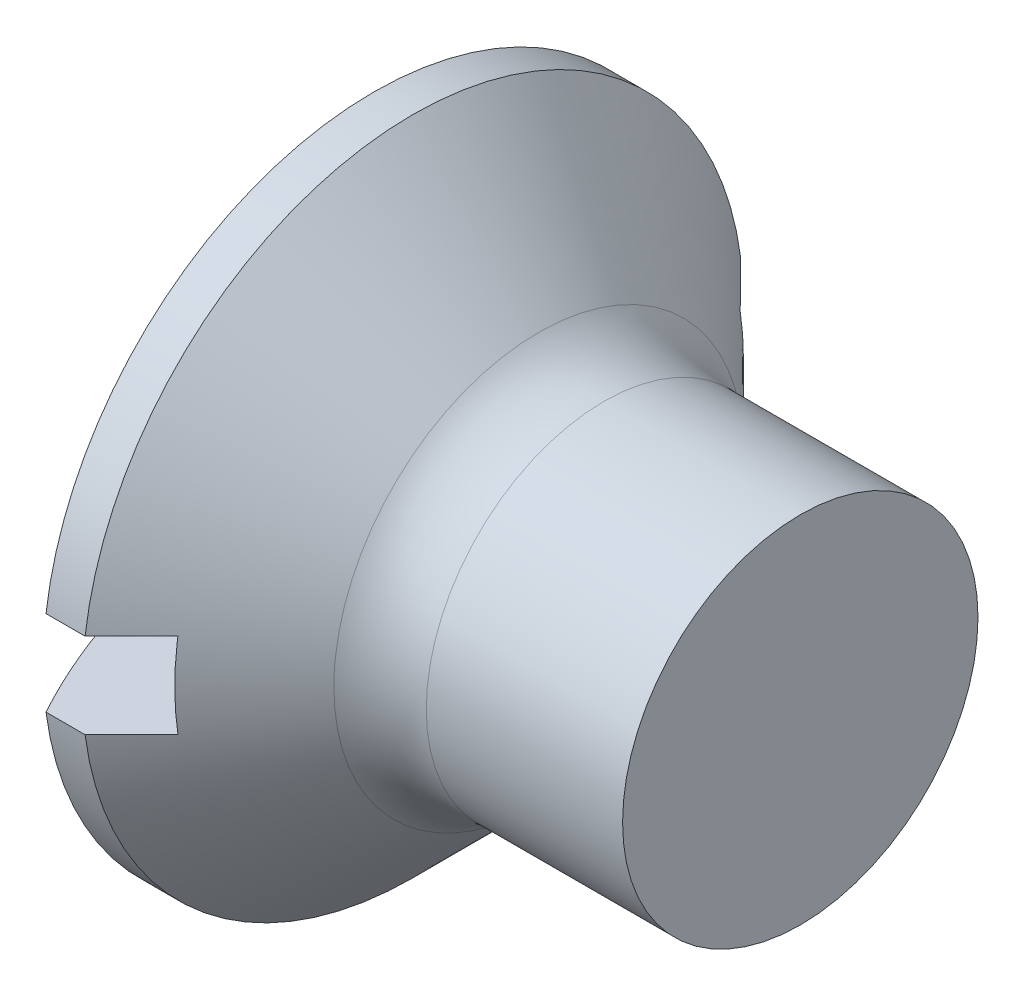
ISO-10303-21;
HEADER;
FILE_DESCRIPTION(('STEP AP214'),'2;1');
FILE_NAME('part.step','',(''),(''),'','','');
FILE_SCHEMA(('AUTOMOTIVE_DESIGN { 1 0 10303 214 1 1 1 1 }'));
ENDSEC;
DATA;
#1=APPLICATION_CONTEXT('core data for automotive mechanical design processes');
#2=APPLICATION_PROTOCOL_DEFINITION('international standard','automotive_design',2000,#1);
#3=PRODUCT_CONTEXT('',#1,'mechanical');
#4=PRODUCT('Part','Part','',(#3));
#5=PRODUCT_RELATED_PRODUCT_CATEGORY('part','',(#4));
#6=PRODUCT_DEFINITION_FORMATION('','',#4);
#7=PRODUCT_DEFINITION_CONTEXT('part definition',#1,'design');
#8=PRODUCT_DEFINITION('design','',#6,#7);
#9=PRODUCT_DEFINITION_SHAPE('','',#8);
#10=(LENGTH_UNIT() NAMED_UNIT(*) SI_UNIT(.MILLI.,.METRE.));
#11=(NAMED_UNIT(*) PLANE_ANGLE_UNIT() SI_UNIT($,.RADIAN.));
#12=(NAMED_UNIT(*) SI_UNIT($,.STERADIAN.) SOLID_ANGLE_UNIT());
#13=UNCERTAINTY_MEASURE_WITH_UNIT(LENGTH_MEASURE(1.E-05),#10,'distance_accuracy_value','');
#14=(GEOMETRIC_REPRESENTATION_CONTEXT(3) GLOBAL_UNCERTAINTY_ASSIGNED_CONTEXT((#13)) GLOBAL_UNIT_ASSIGNED_CONTEXT((#10,
#11,#12)) REPRESENTATION_CONTEXT('',''));
#15=CARTESIAN_POINT('',(0.,0.,0.));
#16=DIRECTION('',(0.,0.,1.));
#17=DIRECTION('',(1.,0.,0.));
#18=AXIS2_PLACEMENT_3D('',#15,#16,#17);
#19=CARTESIAN_POINT('',(9.60937500000001,0.,0.));
#20=DIRECTION('',(-1.,0.,0.));
#21=DIRECTION('',(0.,-1.,0.));
#22=AXIS2_PLACEMENT_3D('',#19,#20,#21);
#23=SPHERICAL_SURFACE('',#22,9.60937500000001);
#24=CARTESIAN_POINT('',(9.60937500000001,0.6,0.));
#25=DIRECTION('',(0.,1.,0.));
#26=DIRECTION('',(0.,0.,1.));
#27=AXIS2_PLACEMENT_3D('',#24,#25,#26);
#28=CIRCLE('',#27,9.59062500000001);
#29=CARTESIAN_POINT('',(1.2,0.6,4.61112784468182));
#30=VERTEX_POINT('',#29);
#31=CARTESIAN_POINT('',(1.2,0.6,-4.61112784468182));
#32=VERTEX_POINT('',#31);
#33=EDGE_CURVE('E182',#30,#32,#28,.F.);
#34=ORIENTED_EDGE('',*,*,#33,.F.);
#35=CARTESIAN_POINT('',(1.2,0.,0.));
#36=DIRECTION('',(-1.,0.,0.));
#37=DIRECTION('',(0.,0.,1.));
#38=AXIS2_PLACEMENT_3D('',#35,#36,#37);
#39=CIRCLE('',#38,4.65);
#40=EDGE_CURVE('E137',#30,#32,#39,.T.);
#41=ORIENTED_EDGE('',*,*,#40,.T.);
#42=EDGE_LOOP('',(#34,#41));
#43=FACE_BOUND('',#42,.T.);
#44=ADVANCED_FACE('F32',(#43),#23,.T.);
#45=CARTESIAN_POINT('',(-15.875,0.,0.));
#46=DIRECTION('',(-1.,0.,0.));
#47=DIRECTION('',(0.,0.,1.));
#48=AXIS2_PLACEMENT_3D('',#45,#46,#47);
#49=CYLINDRICAL_SURFACE('',#48,4.65);
#50=CARTESIAN_POINT('',(1.75000000000001,0.,0.));
#51=DIRECTION('',(-1.,0.,0.));
#52=DIRECTION('',(0.,0.,1.));
#53=AXIS2_PLACEMENT_3D('',#50,#51,#52);
#54=CIRCLE('',#53,4.65);
#55=CARTESIAN_POINT('',(1.75000000000001,0.6,4.61112784468182));
#56=VERTEX_POINT('',#55);
#57=CARTESIAN_POINT('',(1.75,0.6,-4.61112784468182));
#58=VERTEX_POINT('',#57);
#59=EDGE_CURVE('E108',#56,#58,#54,.T.);
#60=ORIENTED_EDGE('',*,*,#59,.T.);
#61=DIRECTION('',(-1.,0.,0.));
#62=VECTOR('',#61,1.);
#63=CARTESIAN_POINT('',(-15.875,0.6,-4.61112784468182));
#64=LINE('',#63,#62);
#65=EDGE_CURVE('E60',#58,#32,#64,.T.);
#66=ORIENTED_EDGE('',*,*,#65,.T.);
#67=ORIENTED_EDGE('',*,*,#40,.F.);
#68=DIRECTION('',(-1.,0.,0.));
#69=VECTOR('',#68,1.);
#70=CARTESIAN_POINT('',(-15.875,0.6,4.61112784468182));
#71=LINE('',#70,#69);
#72=EDGE_CURVE('E177',#30,#56,#71,.F.);
#73=ORIENTED_EDGE('',*,*,#72,.T.);
#74=EDGE_LOOP('',(#60,#66,#67,#73));
#75=FACE_BOUND('',#74,.T.);
#76=ADVANCED_FACE('F158',(#75),#49,.T.);
#77=CARTESIAN_POINT('',(7.2,0.,0.));
#78=DIRECTION('',(-1.,0.,0.));
#79=DIRECTION('',(0.,0.,1.));
#80=AXIS2_PLACEMENT_3D('',#77,#78,#79);
#81=PLANE('',#80);
#82=CARTESIAN_POINT('',(7.2,0.,0.));
#83=DIRECTION('',(-1.,0.,0.));
#84=DIRECTION('',(0.,0.,1.));
#85=AXIS2_PLACEMENT_3D('',#82,#83,#84);
#86=CIRCLE('',#85,2.5);
#87=CARTESIAN_POINT('',(7.2,0.,2.5));
#88=VERTEX_POINT('',#87);
#89=EDGE_CURVE('E130',#88,#88,#86,.T.);
#90=ORIENTED_EDGE('',*,*,#89,.F.);
#91=EDGE_LOOP('',(#90));
#92=FACE_BOUND('',#91,.T.);
#93=ADVANCED_FACE('F166',(#92),#81,.F.);
#94=CARTESIAN_POINT('',(9.60937500000001,-0.599999999999999,0.));
#95=DIRECTION('',(0.,-1.,0.));
#96=DIRECTION('',(0.,0.,-1.));
#97=AXIS2_PLACEMENT_3D('',#94,#95,#96);
#98=CIRCLE('',#97,9.59062500000001);
#99=CARTESIAN_POINT('',(1.2,-0.599999999999999,-4.61112784468182));
#100=VERTEX_POINT('',#99);
#101=CARTESIAN_POINT('',(1.2,-0.6,4.61112784468182));
#102=VERTEX_POINT('',#101);
#103=EDGE_CURVE('E128',#100,#102,#98,.F.);
#104=ORIENTED_EDGE('',*,*,#103,.F.);
#105=EDGE_CURVE('E127',#100,#102,#39,.T.);
#106=ORIENTED_EDGE('',*,*,#105,.T.);
#107=EDGE_LOOP('',(#104,#106));
#108=FACE_BOUND('',#107,.T.);
#109=ADVANCED_FACE('F156',(#108),#23,.T.);
#110=CARTESIAN_POINT('',(1.75000000000001,-0.599999999999999,-4.61112784468182));
#111=VERTEX_POINT('',#110);
#112=CARTESIAN_POINT('',(1.75,-0.6,4.61112784468182));
#113=VERTEX_POINT('',#112);
#114=EDGE_CURVE('E125',#111,#113,#54,.T.);
#115=ORIENTED_EDGE('',*,*,#114,.T.);
#116=DIRECTION('',(-1.,0.,0.));
#117=VECTOR('',#116,1.);
#118=CARTESIAN_POINT('',(-15.875,-0.6,4.61112784468182));
#119=LINE('',#118,#117);
#120=EDGE_CURVE('E175',#113,#102,#119,.T.);
#121=ORIENTED_EDGE('',*,*,#120,.T.);
#122=ORIENTED_EDGE('',*,*,#105,.F.);
#123=DIRECTION('',(-1.,0.,0.));
#124=VECTOR('',#123,1.);
#125=CARTESIAN_POINT('',(-15.875,-0.599999999999999,-4.61112784468182));
#126=LINE('',#125,#124);
#127=EDGE_CURVE('E117',#100,#111,#126,.F.);
#128=ORIENTED_EDGE('',*,*,#127,.T.);
#129=EDGE_LOOP('',(#115,#121,#122,#128));
#130=FACE_BOUND('',#129,.T.);
#131=ADVANCED_FACE('F123',(#130),#49,.T.);
#132=CARTESIAN_POINT('',(1.75000000000001,0.,0.));
#133=DIRECTION('',(-1.,0.,0.));
#134=DIRECTION('',(0.,0.,1.));
#135=AXIS2_PLACEMENT_3D('',#132,#133,#134);
#136=CONICAL_SURFACE('',#135,4.65,0.78539816339745);
#137=CARTESIAN_POINT('',(-3.84381242847589,0.6,-10.226225749014));
#138=CARTESIAN_POINT('',(-3.49703191125939,0.6,-9.87884438655969));
#139=CARTESIAN_POINT('',(-3.15027752264428,0.6,-9.53143692773832));
#140=CARTESIAN_POINT('',(-2.45684919071532,0.6,-8.83653285236268));
#141=CARTESIAN_POINT('',(-2.11017524848928,0.6,-8.48903623472294));
#142=CARTESIAN_POINT('',(-1.41684582915169,0.6,-7.79382645183445));
#143=CARTESIAN_POINT('',(-1.07019038563125,0.6,-7.44611325308074));
#144=CARTESIAN_POINT('',(-0.377062268390139,0.6,-6.75051339510871));
#145=CARTESIAN_POINT('',(-0.0305895924385831,0.6,-6.40262673811342));
#146=CARTESIAN_POINT('',(0.674964546705151,0.6,-5.6936216093589));
#147=CARTESIAN_POINT('',(1.03403537239449,0.6,-5.332492546491));
#148=CARTESIAN_POINT('',(1.57223610307804,0.6,-4.79038223073772));
#149=CARTESIAN_POINT('',(1.75157227236415,0.6,-4.60960579193032));
#150=CARTESIAN_POINT('',(2.11004634429561,0.6,-4.24785782662492));
#151=CARTESIAN_POINT('',(2.28918424772029,0.6,-4.06688630089932));
#152=CARTESIAN_POINT('',(2.64713893894737,0.6,-3.70469095359228));
#153=CARTESIAN_POINT('',(2.82595577933443,0.6,-3.52346718401695));
#154=CARTESIAN_POINT('',(3.18314009775668,0.6,-3.16057192469126));
#155=CARTESIAN_POINT('',(3.36150756896795,0.6,-2.97890042822381));
#156=CARTESIAN_POINT('',(3.71748512153374,0.6,-2.61483934310065));
#157=CARTESIAN_POINT('',(3.89509525439646,0.6,-2.43244980495716));
#158=CARTESIAN_POINT('',(4.16043045122337,0.6,-2.15782564665452));
#159=CARTESIAN_POINT('',(4.24869444362529,0.6,-2.06611207998194));
#160=CARTESIAN_POINT('',(4.42468861400715,0.6,-1.8821745596906));
#161=CARTESIAN_POINT('',(4.51241879678702,0.6,-1.78995061067541));
#162=CARTESIAN_POINT('',(4.64664685925991,0.6,-1.64757956778599));
#163=CARTESIAN_POINT('',(4.69343878974776,0.6,-1.59770988001651));
#164=CARTESIAN_POINT('',(4.78670922549868,0.6,-1.49767655836918));
#165=CARTESIAN_POINT('',(4.83318772572392,0.6,-1.44751291979071));
#166=CARTESIAN_POINT('',(4.92555898538252,0.6,-1.34698552522522));
#167=CARTESIAN_POINT('',(4.97145326421329,0.6,-1.29662316947425));
#168=CARTESIAN_POINT('',(5.06266587367226,0.6,-1.19538344053142));
#169=CARTESIAN_POINT('',(5.10798422488764,0.6,-1.14450608586623));
#170=CARTESIAN_POINT('',(5.21306588098941,0.6,-1.02465834689705));
#171=CARTESIAN_POINT('',(5.27251260857665,0.6,-0.955406728952978));
#172=CARTESIAN_POINT('',(5.35998482036335,0.6,-0.849716109638148));
#173=CARTESIAN_POINT('',(5.38895406912751,0.6,-0.814060318993797));
#174=CARTESIAN_POINT('',(5.44599130805581,0.6,-0.742037258450741));
#175=CARTESIAN_POINT('',(5.47405939416916,0.6,-0.70567006496497));
#176=CARTESIAN_POINT('',(5.52929508454557,0.6,-0.631466905044505));
#177=CARTESIAN_POINT('',(5.55644491137923,0.6,-0.593617593786866));
#178=CARTESIAN_POINT('',(5.60881210964928,0.6,-0.516510606043993));
#179=CARTESIAN_POINT('',(5.63402681372342,0.6,-0.477251091342738));
#180=CARTESIAN_POINT('',(5.68112300031146,0.6,-0.39726600148424));
#181=CARTESIAN_POINT('',(5.70303523068318,0.6,-0.356558962866782));
#182=CARTESIAN_POINT('',(5.74189361592259,0.6,-0.272899399845278));
#183=CARTESIAN_POINT('',(5.75885561831414,0.6,-0.22995457162164));
#184=CARTESIAN_POINT('',(5.78384427188174,0.6,-0.145307247159684));
#185=CARTESIAN_POINT('',(5.79250570565868,0.6,-0.103807262678562));
#186=CARTESIAN_POINT('',(5.79896559664364,0.6,-0.0409921490997936));
#187=CARTESIAN_POINT('',(5.80003407413791,0.6,-0.0199976523728678));
#188=CARTESIAN_POINT('',(5.79996427738863,0.6,0.0219867048350173));
#189=CARTESIAN_POINT('',(5.79882592503674,0.6,0.0429765651255772));
#190=CARTESIAN_POINT('',(5.79221081337584,0.6,0.105351524998509));
#191=CARTESIAN_POINT('',(5.7835615419579,0.6,0.146424565130919));
#192=CARTESIAN_POINT('',(5.76572756777995,0.6,0.206592373900107));
#193=CARTESIAN_POINT('',(5.7589382685515,0.6,0.22647968253039));
#194=CARTESIAN_POINT('',(5.7440299651832,0.6,0.265751365588189));
#195=CARTESIAN_POINT('',(5.73591118212823,0.6,0.285135823016918));
#196=CARTESIAN_POINT('',(5.71153019559278,0.6,0.339055041687462));
#197=CARTESIAN_POINT('',(5.69403452446651,0.6,0.373027048999671));
#198=CARTESIAN_POINT('',(5.65667200204135,0.6,0.439654667031098));
#199=CARTESIAN_POINT('',(5.63680248490988,0.6,0.472308741620941));
#200=CARTESIAN_POINT('',(5.59537924013787,0.6,0.536677952223172));
#201=CARTESIAN_POINT('',(5.57382001377515,0.6,0.568389516790789));
#202=CARTESIAN_POINT('',(5.52955242473855,0.6,0.631004114035502));
#203=CARTESIAN_POINT('',(5.50684378338501,0.6,0.661906947851169));
#204=CARTESIAN_POINT('',(5.43705704451508,0.6,0.754263540750807));
#205=CARTESIAN_POINT('',(5.38872346573867,0.6,0.81476449944855));
#206=CARTESIAN_POINT('',(5.29032368599152,0.6,0.934075426062692));
#207=CARTESIAN_POINT('',(5.24026180111135,0.6,0.992889017533465));
#208=CARTESIAN_POINT('',(5.14005200265263,0.6,1.10827296621777));
#209=CARTESIAN_POINT('',(5.08992836517224,0.6,1.16486445218159));
#210=CARTESIAN_POINT('',(4.98893904528058,0.6,1.27738094295611));
#211=CARTESIAN_POINT('',(4.93807334440349,0.6,1.33330593111825));
#212=CARTESIAN_POINT('',(4.78469772190168,0.6,1.50039347428382));
#213=CARTESIAN_POINT('',(4.68142310868749,0.6,1.61085297829195));
#214=CARTESIAN_POINT('',(4.47365819738919,0.6,1.83086638991376));
#215=CARTESIAN_POINT('',(4.36916659154449,0.6,1.94041905458624));
#216=CARTESIAN_POINT('',(4.15951616614035,0.6,2.15886758887876));
#217=CARTESIAN_POINT('',(4.05435739861549,0.6,2.26776350845955));
#218=CARTESIAN_POINT('',(3.84467888066664,0.6,2.48401989958627));
#219=CARTESIAN_POINT('',(3.74016357881617,0.6,2.59138469138828));
#220=CARTESIAN_POINT('',(3.53083303756517,0.6,2.80582555243348));
#221=CARTESIAN_POINT('',(3.42601779221016,0.6,2.91290161586172));
#222=CARTESIAN_POINT('',(3.11135789097321,0.6,3.23371662663702));
#223=CARTESIAN_POINT('',(2.90119800535926,0.6,3.44714625014219));
#224=CARTESIAN_POINT('',(2.42216110418072,0.6,3.93257208957493));
#225=CARTESIAN_POINT('',(2.15313704665842,0.6,4.20442302855114));
#226=CARTESIAN_POINT('',(1.61466453717124,0.6,4.74770566964327));
#227=CARTESIAN_POINT('',(1.34521608393632,0.6,5.01913737049975));
#228=CARTESIAN_POINT('',(0.536382054130206,0.6,5.83316703169518));
#229=CARTESIAN_POINT('',(-0.00338228620713006,0.6,6.37538852587129));
#230=CARTESIAN_POINT('',(-1.09316783703136,0.6,7.46925314070672));
#231=CARTESIAN_POINT('',(-1.64319706063646,0.6,8.02088827191534));
#232=CARTESIAN_POINT('',(-2.74340733116403,0.6,9.12377184819501));
#233=CARTESIAN_POINT('',(-3.29358832048115,0.6,9.67502035072541));
#234=CARTESIAN_POINT('',(-3.84381242847589,0.6,10.226225749014));
#235=B_SPLINE_CURVE_WITH_KNOTS('',3,(#137,#138,#139,#140,#141,#142,#143,#144,#145,#146,#147,
#148,#149,#150,#151,#152,#153,#154,#155,#156,#157,#158,#159,#160,#161,#162,#163,#164,#165,#166,
#167,#168,#169,#170,#171,#172,#173,#174,#175,#176,#177,#178,#179,#180,#181,#182,#183,#184,#185,
#186,#187,#188,#189,#190,#191,#192,#193,#194,#195,#196,#197,#198,#199,#200,#201,#202,#203,#204,
#205,#206,#207,#208,#209,#210,#211,#212,#213,#214,#215,#216,#217,#218,#219,#220,#221,#222,#223,
#224,#225,#226,#227,#228,#229,#230,#231,#232,#233,#234),.UNSPECIFIED.,.F.,.F.,(4,2,2,2,2,2,2,2,
2,2,2,2,2,2,2,2,2,2,2,2,2,2,2,2,2,2,2,2,2,2,2,2,2,2,2,2,2,2,2,2,2,2,2,2,2,2,2,2,4),(0.,
1.47254028033935,2.94509943058809,4.41807941698618,5.89104098758995,7.41882150868399,
8.18274170996321,8.94665889772888,9.7104368274971,10.4742262865827,11.2379629425419,
11.6198219309646,12.0016774806774,12.2068306173587,12.4119870436827,12.6163941049013,
12.8207938386901,13.0945526434861,13.2323650590986,13.3701627524639,13.509862505868,
13.6497514854044,13.7882446842768,13.9262895250426,14.0526500441239,14.1156054318432,
14.1785630478409,14.3036433363278,14.3666567696334,14.4296597348187,14.5441423750417,
14.6587548097519,14.7737570819718,14.8887873717133,15.1210189668236,15.3527074839118,
15.5794891921343,15.8062765533459,16.2599138706394,16.7140944534709,17.168240038088,
17.6177455590324,18.0672600663472,18.9658543430646,20.1132384290357,21.2606259551791,
23.5558696781878,25.8928551296018,28.2293409127701),.UNSPECIFIED.);
#236=CARTESIAN_POINT('',(2.4,0.6,-3.95474398665704));
#237=VERTEX_POINT('',#236);
#238=EDGE_CURVE('E11',#58,#237,#235,.T.);
#239=ORIENTED_EDGE('',*,*,#238,.F.);
#240=ORIENTED_EDGE('',*,*,#59,.F.);
#241=CARTESIAN_POINT('',(2.4,0.6,3.95474398665704));
#242=VERTEX_POINT('',#241);
#243=EDGE_CURVE('E36',#242,#56,#235,.T.);
#244=ORIENTED_EDGE('',*,*,#243,.F.);
#245=CARTESIAN_POINT('',(2.4,0.,0.));
#246=DIRECTION('',(-1.,0.,0.));
#247=DIRECTION('',(0.,0.,1.));
#248=AXIS2_PLACEMENT_3D('',#245,#246,#247);
#249=CIRCLE('',#248,4.);
#250=CARTESIAN_POINT('',(2.4,-0.6,3.95474398665704));
#251=VERTEX_POINT('',#250);
#252=EDGE_CURVE('E89',#242,#251,#249,.F.);
#253=ORIENTED_EDGE('',*,*,#252,.T.);
#254=CARTESIAN_POINT('',(-3.84381242847589,-0.600000000000001,10.226225749014));
#255=CARTESIAN_POINT('',(-3.49703191125939,-0.600000000000001,9.87884438655969));
#256=CARTESIAN_POINT('',(-3.15027752264429,-0.600000000000001,9.53143692773832));
#257=CARTESIAN_POINT('',(-2.45684919071532,-0.600000000000001,8.83653285236268));
#258=CARTESIAN_POINT('',(-2.11017524848927,-0.6,8.48903623472294));
#259=CARTESIAN_POINT('',(-1.41684582915169,-0.6,7.79382645183445));
#260=CARTESIAN_POINT('',(-1.07019038563125,-0.6,7.44611325308074));
#261=CARTESIAN_POINT('',(-0.377062268390138,-0.6,6.75051339510871));
#262=CARTESIAN_POINT('',(-0.0305895924385812,-0.6,6.40262673811342));
#263=CARTESIAN_POINT('',(0.674964546705155,-0.6,5.6936216093589));
#264=CARTESIAN_POINT('',(1.0340353723945,-0.6,5.332492546491));
#265=CARTESIAN_POINT('',(1.57223610307804,-0.6,4.79038223073772));
#266=CARTESIAN_POINT('',(1.75157227236415,-0.6,4.60960579193032));
#267=CARTESIAN_POINT('',(2.11004634429561,-0.6,4.24785782662492));
#268=CARTESIAN_POINT('',(2.2891842477203,-0.6,4.06688630089932));
#269=CARTESIAN_POINT('',(2.64713893894738,-0.6,3.70469095359228));
#270=CARTESIAN_POINT('',(2.82595577933444,-0.6,3.52346718401695));
#271=CARTESIAN_POINT('',(3.18314009775669,-0.6,3.16057192469126));
#272=CARTESIAN_POINT('',(3.36150756896795,-0.6,2.9789004282238));
#273=CARTESIAN_POINT('',(3.71748512153374,-0.6,2.61483934310065));
#274=CARTESIAN_POINT('',(3.89509525439647,-0.6,2.43244980495715));
#275=CARTESIAN_POINT('',(4.16043045122337,-0.6,2.15782564665452));
#276=CARTESIAN_POINT('',(4.24869444362529,-0.6,2.06611207998194));
#277=CARTESIAN_POINT('',(4.42468861400715,-0.6,1.8821745596906));
#278=CARTESIAN_POINT('',(4.51241879678703,-0.6,1.78995061067541));
#279=CARTESIAN_POINT('',(4.64664685925991,-0.6,1.64757956778599));
#280=CARTESIAN_POINT('',(4.69343878974776,-0.6,1.59770988001651));
#281=CARTESIAN_POINT('',(4.78670922549868,-0.6,1.49767655836918));
#282=CARTESIAN_POINT('',(4.83318772572392,-0.6,1.44751291979071));
#283=CARTESIAN_POINT('',(4.92555898538252,-0.6,1.34698552522522));
#284=CARTESIAN_POINT('',(4.97145326421329,-0.6,1.29662316947425));
#285=CARTESIAN_POINT('',(5.06266587367226,-0.6,1.19538344053141));
#286=CARTESIAN_POINT('',(5.10798422488764,-0.6,1.14450608586623));
#287=CARTESIAN_POINT('',(5.21306588098941,-0.6,1.02465834689705));
#288=CARTESIAN_POINT('',(5.27251260857665,-0.6,0.955406728952978));
#289=CARTESIAN_POINT('',(5.35998482036335,-0.6,0.849716109638148));
#290=CARTESIAN_POINT('',(5.38895406912751,-0.599999999999999,0.814060318993797));
#291=CARTESIAN_POINT('',(5.44599130805581,-0.599999999999999,0.742037258450741));
#292=CARTESIAN_POINT('',(5.47405939416916,-0.599999999999999,0.70567006496497));
#293=CARTESIAN_POINT('',(5.52929508454557,-0.599999999999999,0.631466905044505));
#294=CARTESIAN_POINT('',(5.55644491137923,-0.599999999999999,0.593617593786867));
#295=CARTESIAN_POINT('',(5.60881210964928,-0.599999999999999,0.516510606043993));
#296=CARTESIAN_POINT('',(5.63402681372342,-0.599999999999999,0.477251091342738));
#297=CARTESIAN_POINT('',(5.68112300031146,-0.599999999999999,0.39726600148424));
#298=CARTESIAN_POINT('',(5.70303523068318,-0.599999999999999,0.356558962866781));
#299=CARTESIAN_POINT('',(5.74189361592259,-0.599999999999999,0.272899399845277));
#300=CARTESIAN_POINT('',(5.75885561831414,-0.599999999999999,0.229954571621639));
#301=CARTESIAN_POINT('',(5.78384427188174,-0.599999999999999,0.145307247159683));
#302=CARTESIAN_POINT('',(5.79250570565868,-0.6,0.103807262678561));
#303=CARTESIAN_POINT('',(5.79896559664364,-0.599999999999999,0.0409921490997932));
#304=CARTESIAN_POINT('',(5.80003407413791,-0.599999999999999,0.0199976523728674));
#305=CARTESIAN_POINT('',(5.79996427738863,-0.599999999999999,-0.0219867048350176));
#306=CARTESIAN_POINT('',(5.79882592503674,-0.599999999999999,-0.0429765651255774));
#307=CARTESIAN_POINT('',(5.79221081337584,-0.599999999999999,-0.105351524998509));
#308=CARTESIAN_POINT('',(5.7835615419579,-0.599999999999999,-0.146424565130919));
#309=CARTESIAN_POINT('',(5.76572756777995,-0.599999999999999,-0.206592373900107));
#310=CARTESIAN_POINT('',(5.7589382685515,-0.599999999999999,-0.22647968253039));
#311=CARTESIAN_POINT('',(5.7440299651832,-0.599999999999999,-0.26575136558819));
#312=CARTESIAN_POINT('',(5.73591118212822,-0.599999999999999,-0.285135823016918));
#313=CARTESIAN_POINT('',(5.71153019559277,-0.599999999999999,-0.339055041687462));
#314=CARTESIAN_POINT('',(5.69403452446651,-0.599999999999999,-0.373027048999671));
#315=CARTESIAN_POINT('',(5.65667200204135,-0.599999999999999,-0.439654667031099));
#316=CARTESIAN_POINT('',(5.63680248490988,-0.599999999999999,-0.472308741620941));
#317=CARTESIAN_POINT('',(5.59537924013787,-0.599999999999999,-0.536677952223173));
#318=CARTESIAN_POINT('',(5.57382001377515,-0.599999999999999,-0.568389516790789));
#319=CARTESIAN_POINT('',(5.52955242473855,-0.599999999999999,-0.631004114035503));
#320=CARTESIAN_POINT('',(5.50684378338501,-0.599999999999999,-0.661906947851171));
#321=CARTESIAN_POINT('',(5.43705704451508,-0.599999999999999,-0.754263540750808));
#322=CARTESIAN_POINT('',(5.38872346573867,-0.599999999999999,-0.814764499448551));
#323=CARTESIAN_POINT('',(5.29032368599152,-0.599999999999999,-0.934075426062693));
#324=CARTESIAN_POINT('',(5.24026180111135,-0.599999999999999,-0.992889017533467));
#325=CARTESIAN_POINT('',(5.14005200265263,-0.599999999999999,-1.10827296621777));
#326=CARTESIAN_POINT('',(5.08992836517224,-0.599999999999999,-1.16486445218159));
#327=CARTESIAN_POINT('',(4.98893904528058,-0.599999999999999,-1.27738094295611));
#328=CARTESIAN_POINT('',(4.93807334440349,-0.599999999999999,-1.33330593111825));
#329=CARTESIAN_POINT('',(4.78469772190168,-0.599999999999999,-1.50039347428382));
#330=CARTESIAN_POINT('',(4.68142310868749,-0.599999999999999,-1.61085297829195));
#331=CARTESIAN_POINT('',(4.47365819738919,-0.599999999999999,-1.83086638991376));
#332=CARTESIAN_POINT('',(4.36916659154449,-0.599999999999999,-1.94041905458624));
#333=CARTESIAN_POINT('',(4.15951616614035,-0.599999999999999,-2.15886758887876));
#334=CARTESIAN_POINT('',(4.05435739861549,-0.599999999999999,-2.26776350845955));
#335=CARTESIAN_POINT('',(3.84467888066664,-0.599999999999999,-2.48401989958627));
#336=CARTESIAN_POINT('',(3.74016357881617,-0.599999999999999,-2.59138469138828));
#337=CARTESIAN_POINT('',(3.53083303756517,-0.599999999999999,-2.80582555243348));
#338=CARTESIAN_POINT('',(3.42601779221016,-0.599999999999999,-2.91290161586172));
#339=CARTESIAN_POINT('',(3.1113578909732,-0.599999999999999,-3.23371662663702));
#340=CARTESIAN_POINT('',(2.90119800535925,-0.599999999999999,-3.4471462501422));
#341=CARTESIAN_POINT('',(2.42216110418071,-0.599999999999999,-3.93257208957493));
#342=CARTESIAN_POINT('',(2.15313704665842,-0.599999999999999,-4.20442302855115));
#343=CARTESIAN_POINT('',(1.61466453717123,-0.599999999999999,-4.74770566964327));
#344=CARTESIAN_POINT('',(1.34521608393631,-0.599999999999999,-5.01913737049975));
#345=CARTESIAN_POINT('',(0.536382054130197,-0.599999999999999,-5.83316703169519));
#346=CARTESIAN_POINT('',(-0.00338228620713971,-0.599999999999999,-6.3753885258713));
#347=CARTESIAN_POINT('',(-1.09316783703137,-0.599999999999998,-7.46925314070673));
#348=CARTESIAN_POINT('',(-1.64319706063647,-0.599999999999998,-8.02088827191535));
#349=CARTESIAN_POINT('',(-2.74340733116403,-0.599999999999998,-9.12377184819501));
#350=CARTESIAN_POINT('',(-3.29358832048115,-0.599999999999998,-9.67502035072541));
#351=CARTESIAN_POINT('',(-3.84381242847589,-0.599999999999998,-10.226225749014));
#352=B_SPLINE_CURVE_WITH_KNOTS('',3,(#254,#255,#256,#257,#258,#259,#260,#261,#262,#263,#264,
#265,#266,#267,#268,#269,#270,#271,#272,#273,#274,#275,#276,#277,#278,#279,#280,#281,#282,#283,
#284,#285,#286,#287,#288,#289,#290,#291,#292,#293,#294,#295,#296,#297,#298,#299,#300,#301,#302,
#303,#304,#305,#306,#307,#308,#309,#310,#311,#312,#313,#314,#315,#316,#317,#318,#319,#320,#321,
#322,#323,#324,#325,#326,#327,#328,#329,#330,#331,#332,#333,#334,#335,#336,#337,#338,#339,#340,
#341,#342,#343,#344,#345,#346,#347,#348,#349,#350,#351),.UNSPECIFIED.,.F.,.F.,(4,2,2,2,2,2,2,2,
2,2,2,2,2,2,2,2,2,2,2,2,2,2,2,2,2,2,2,2,2,2,2,2,2,2,2,2,2,2,2,2,2,2,2,2,2,2,2,2,4),(0.,
1.47254028033935,2.94509943058809,4.41807941698618,5.89104098758995,7.41882150868399,
8.18274170996321,8.94665889772888,9.7104368274971,10.4742262865827,11.2379629425419,
11.6198219309646,12.0016774806774,12.2068306173587,12.4119870436827,12.6163941049013,
12.8207938386901,13.0945526434861,13.2323650590986,13.3701627524639,13.509862505868,
13.6497514854044,13.7882446842768,13.9262895250426,14.0526500441239,14.1156054318432,
14.1785630478409,14.3036433363278,14.3666567696334,14.4296597348187,14.5441423750417,
14.6587548097519,14.7737570819718,14.8887873717133,15.1210189668236,15.3527074839118,
15.5794891921343,15.8062765533459,16.2599138706393,16.7140944534709,17.168240038088,
17.6177455590324,18.0672600663472,18.9658543430645,20.1132384290356,21.2606259551791,
23.5558696781878,25.8928551296017,28.2293409127701),.UNSPECIFIED.);
#353=EDGE_CURVE('E97',#113,#251,#352,.T.);
#354=ORIENTED_EDGE('',*,*,#353,.F.);
#355=ORIENTED_EDGE('',*,*,#114,.F.);
#356=CARTESIAN_POINT('',(2.4,-0.599999999999999,-3.95474398665704));
#357=VERTEX_POINT('',#356);
#358=EDGE_CURVE('E46',#357,#111,#352,.T.);
#359=ORIENTED_EDGE('',*,*,#358,.F.);
#360=EDGE_CURVE('E100',#357,#237,#249,.F.);
#361=ORIENTED_EDGE('',*,*,#360,.T.);
#362=EDGE_LOOP('',(#239,#240,#244,#253,#354,#355,#359,#361));
#363=FACE_BOUND('',#362,.T.);
#364=CARTESIAN_POINT('',(3.51923881554251,0.,0.));
#365=DIRECTION('',(1.,0.,0.));
#366=DIRECTION('',(0.,0.,-1.));
#367=AXIS2_PLACEMENT_3D('',#364,#365,#366);
#368=CIRCLE('',#367,2.88076118445749);
#369=CARTESIAN_POINT('',(3.51923881554251,0.,-2.88076118445749));
#370=VERTEX_POINT('',#369);
#371=EDGE_CURVE('E138',#370,#370,#368,.F.);
#372=ORIENTED_EDGE('',*,*,#371,.T.);
#373=EDGE_LOOP('',(#372));
#374=FACE_BOUND('',#373,.T.);
#375=ADVANCED_FACE('F105',(#363,#374),#136,.T.);
#376=CARTESIAN_POINT('',(-15.875,0.,0.));
#377=DIRECTION('',(-1.,0.,0.));
#378=DIRECTION('',(0.,0.,1.));
#379=AXIS2_PLACEMENT_3D('',#376,#377,#378);
#380=CYLINDRICAL_SURFACE('',#379,2.5);
#381=CARTESIAN_POINT('',(4.43847763108502,0.,0.));
#382=DIRECTION('',(-1.,0.,0.));
#383=DIRECTION('',(0.,0.,1.));
#384=AXIS2_PLACEMENT_3D('',#381,#382,#383);
#385=CIRCLE('',#384,2.5);
#386=CARTESIAN_POINT('',(4.43847763108502,0.,2.5));
#387=VERTEX_POINT('',#386);
#388=EDGE_CURVE('E98',#387,#387,#385,.F.);
#389=ORIENTED_EDGE('',*,*,#388,.T.);
#390=EDGE_LOOP('',(#389));
#391=FACE_BOUND('',#390,.T.);
#392=ORIENTED_EDGE('',*,*,#89,.T.);
#393=EDGE_LOOP('',(#392));
#394=FACE_BOUND('',#393,.T.);
#395=ADVANCED_FACE('F144',(#391,#394),#380,.T.);
#396=CARTESIAN_POINT('',(4.43847763108502,0.,0.));
#397=DIRECTION('',(-1.,0.,0.));
#398=DIRECTION('',(0.,0.,1.));
#399=AXIS2_PLACEMENT_3D('',#396,#397,#398);
#400=TOROIDAL_SURFACE('',#399,3.8,1.3);
#401=ORIENTED_EDGE('',*,*,#388,.F.);
#402=EDGE_LOOP('',(#401));
#403=FACE_BOUND('',#402,.T.);
#404=ORIENTED_EDGE('',*,*,#371,.F.);
#405=EDGE_LOOP('',(#404));
#406=FACE_BOUND('',#405,.T.);
#407=ADVANCED_FACE('F34',(#403,#406),#400,.F.);
#408=CARTESIAN_POINT('',(2.4,0.6,4.65));
#409=DIRECTION('',(0.,1.,0.));
#410=DIRECTION('',(0.,0.,1.));
#411=AXIS2_PLACEMENT_3D('',#408,#409,#410);
#412=PLANE('',#411);
#413=ORIENTED_EDGE('',*,*,#238,.T.);
#414=DIRECTION('',(0.,0.,-1.));
#415=VECTOR('',#414,1.);
#416=CARTESIAN_POINT('',(2.4,0.6,4.65));
#417=LINE('',#416,#415);
#418=EDGE_CURVE('E92',#242,#237,#417,.T.);
#419=ORIENTED_EDGE('',*,*,#418,.F.);
#420=ORIENTED_EDGE('',*,*,#243,.T.);
#421=ORIENTED_EDGE('',*,*,#72,.F.);
#422=ORIENTED_EDGE('',*,*,#33,.T.);
#423=ORIENTED_EDGE('',*,*,#65,.F.);
#424=EDGE_LOOP('',(#413,#419,#420,#421,#422,#423));
#425=FACE_BOUND('',#424,.T.);
#426=ADVANCED_FACE('F101',(#425),#412,.F.);
#427=CARTESIAN_POINT('',(2.4,-0.599999999999999,-4.65));
#428=DIRECTION('',(0.,-1.,0.));
#429=DIRECTION('',(0.,0.,-1.));
#430=AXIS2_PLACEMENT_3D('',#427,#428,#429);
#431=PLANE('',#430);
#432=ORIENTED_EDGE('',*,*,#353,.T.);
#433=DIRECTION('',(0.,0.,1.));
#434=VECTOR('',#433,1.);
#435=CARTESIAN_POINT('',(2.4,-0.599999999999999,-4.65));
#436=LINE('',#435,#434);
#437=EDGE_CURVE('E53',#357,#251,#436,.T.);
#438=ORIENTED_EDGE('',*,*,#437,.F.);
#439=ORIENTED_EDGE('',*,*,#358,.T.);
#440=ORIENTED_EDGE('',*,*,#127,.F.);
#441=ORIENTED_EDGE('',*,*,#103,.T.);
#442=ORIENTED_EDGE('',*,*,#120,.F.);
#443=EDGE_LOOP('',(#432,#438,#439,#440,#441,#442));
#444=FACE_BOUND('',#443,.T.);
#445=ADVANCED_FACE('F116',(#444),#431,.F.);
#446=CARTESIAN_POINT('',(2.4,0.6,-4.65));
#447=DIRECTION('',(-1.,0.,0.));
#448=DIRECTION('',(0.,0.,1.));
#449=AXIS2_PLACEMENT_3D('',#446,#447,#448);
#450=PLANE('',#449);
#451=ORIENTED_EDGE('',*,*,#437,.T.);
#452=ORIENTED_EDGE('',*,*,#252,.F.);
#453=ORIENTED_EDGE('',*,*,#418,.T.);
#454=ORIENTED_EDGE('',*,*,#360,.F.);
#455=EDGE_LOOP('',(#451,#452,#453,#454));
#456=FACE_BOUND('',#455,.T.);
#457=ADVANCED_FACE('F91',(#456),#450,.T.);
#458=CLOSED_SHELL('',(#44,#76,#93,#109,#131,#375,#395,#407,#426,#445,#457));
#459=MANIFOLD_SOLID_BREP('B2',#458);
#460=ADVANCED_BREP_SHAPE_REPRESENTATION('',(#18,#459),#14);
#461=SHAPE_DEFINITION_REPRESENTATION(#9,#460);
ENDSEC;
END-ISO-10303-21;
